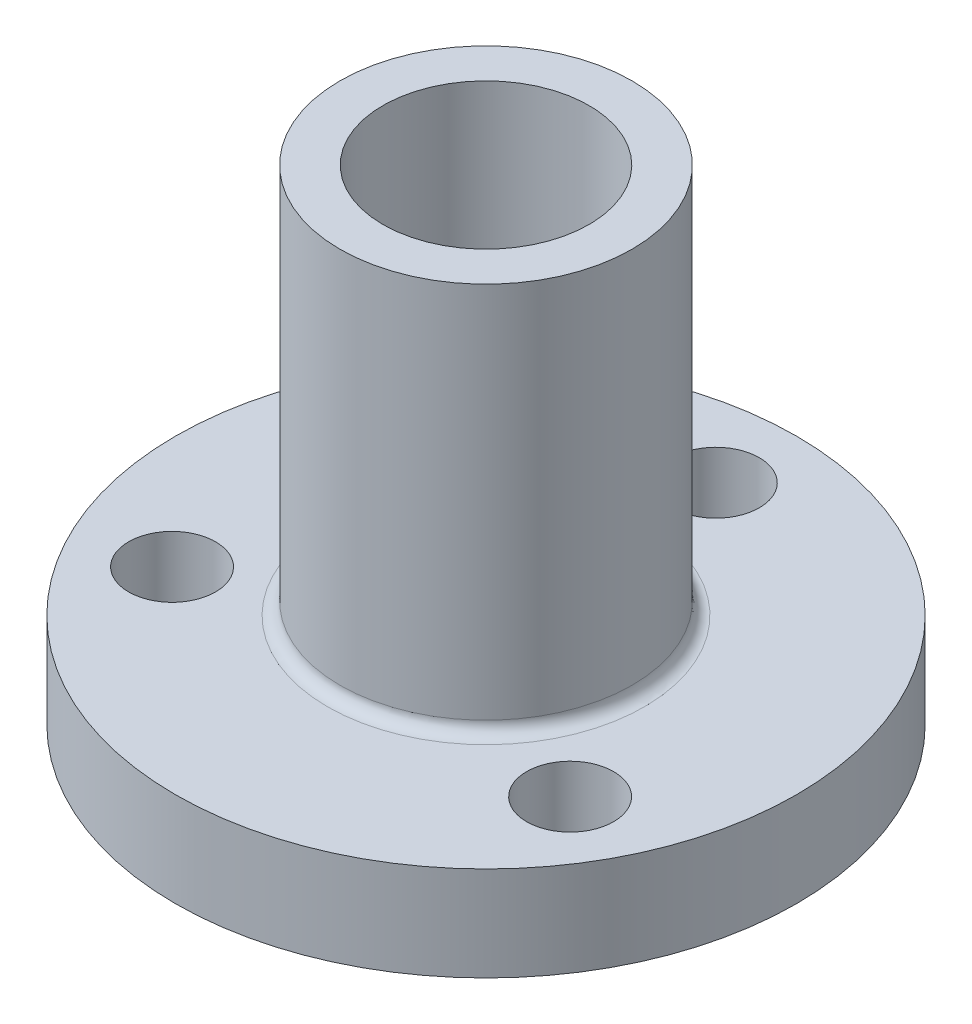
ISO-10303-21;
HEADER;
FILE_DESCRIPTION(('STEP AP214'),'2;1');
FILE_NAME('part.step','',(''),(''),'','','');
FILE_SCHEMA(('AUTOMOTIVE_DESIGN { 1 0 10303 214 1 1 1 1 }'));
ENDSEC;
DATA;
#1=APPLICATION_CONTEXT('core data for automotive mechanical design processes');
#2=APPLICATION_PROTOCOL_DEFINITION('international standard','automotive_design',2000,#1);
#3=PRODUCT_CONTEXT('',#1,'mechanical');
#4=PRODUCT('Part','Part','',(#3));
#5=PRODUCT_RELATED_PRODUCT_CATEGORY('part','',(#4));
#6=PRODUCT_DEFINITION_FORMATION('','',#4);
#7=PRODUCT_DEFINITION_CONTEXT('part definition',#1,'design');
#8=PRODUCT_DEFINITION('design','',#6,#7);
#9=PRODUCT_DEFINITION_SHAPE('','',#8);
#10=(LENGTH_UNIT() NAMED_UNIT(*) SI_UNIT(.MILLI.,.METRE.));
#11=(NAMED_UNIT(*) PLANE_ANGLE_UNIT() SI_UNIT($,.RADIAN.));
#12=(NAMED_UNIT(*) SI_UNIT($,.STERADIAN.) SOLID_ANGLE_UNIT());
#13=UNCERTAINTY_MEASURE_WITH_UNIT(LENGTH_MEASURE(1.E-05),#10,'distance_accuracy_value','');
#14=(GEOMETRIC_REPRESENTATION_CONTEXT(3) GLOBAL_UNCERTAINTY_ASSIGNED_CONTEXT((#13)) GLOBAL_UNIT_ASSIGNED_CONTEXT((#10,
#11,#12)) REPRESENTATION_CONTEXT('',''));
#15=CARTESIAN_POINT('',(0.,0.,0.));
#16=DIRECTION('',(0.,0.,1.));
#17=DIRECTION('',(1.,0.,0.));
#18=AXIS2_PLACEMENT_3D('',#15,#16,#17);
#19=CARTESIAN_POINT('',(-8.01073498500604,3.8,4.62500000000004));
#20=DIRECTION('',(0.,-1.,0.));
#21=DIRECTION('',(0.,0.,-1.));
#22=AXIS2_PLACEMENT_3D('',#19,#20,#21);
#23=CYLINDRICAL_SURFACE('',#22,1.75);
#24=CARTESIAN_POINT('',(-8.01073498500604,3.8,4.62500000000004));
#25=DIRECTION('',(0.,1.,0.));
#26=DIRECTION('',(0.,0.,1.));
#27=AXIS2_PLACEMENT_3D('',#24,#25,#26);
#28=CIRCLE('',#27,1.75);
#29=CARTESIAN_POINT('',(-8.01073498500604,3.8,6.37500000000004));
#30=VERTEX_POINT('',#29);
#31=EDGE_CURVE('E50',#30,#30,#28,.T.);
#32=ORIENTED_EDGE('',*,*,#31,.T.);
#33=EDGE_LOOP('',(#32));
#34=FACE_BOUND('',#33,.T.);
#35=CARTESIAN_POINT('',(-8.01073498500604,0.,4.62500000000004));
#36=DIRECTION('',(0.,1.,0.));
#37=DIRECTION('',(0.,0.,1.));
#38=AXIS2_PLACEMENT_3D('',#35,#36,#37);
#39=CIRCLE('',#38,1.75);
#40=CARTESIAN_POINT('',(-8.01073498500604,0.,6.37500000000004));
#41=VERTEX_POINT('',#40);
#42=EDGE_CURVE('E57',#41,#41,#39,.T.);
#43=ORIENTED_EDGE('',*,*,#42,.F.);
#44=EDGE_LOOP('',(#43));
#45=FACE_BOUND('',#44,.T.);
#46=ADVANCED_FACE('F35',(#34,#45),#23,.F.);
#47=CARTESIAN_POINT('',(0.,3.8,-9.25));
#48=DIRECTION('',(0.,-1.,0.));
#49=DIRECTION('',(0.,0.,-1.));
#50=AXIS2_PLACEMENT_3D('',#47,#48,#49);
#51=CYLINDRICAL_SURFACE('',#50,1.75);
#52=CARTESIAN_POINT('',(0.,3.8,-9.25));
#53=DIRECTION('',(0.,1.,0.));
#54=DIRECTION('',(0.,0.,1.));
#55=AXIS2_PLACEMENT_3D('',#52,#53,#54);
#56=CIRCLE('',#55,1.75);
#57=CARTESIAN_POINT('',(0.,3.8,-7.5));
#58=VERTEX_POINT('',#57);
#59=EDGE_CURVE('E69',#58,#58,#56,.T.);
#60=ORIENTED_EDGE('',*,*,#59,.T.);
#61=EDGE_LOOP('',(#60));
#62=FACE_BOUND('',#61,.T.);
#63=CARTESIAN_POINT('',(0.,0.,-9.25));
#64=DIRECTION('',(0.,1.,0.));
#65=DIRECTION('',(0.,0.,1.));
#66=AXIS2_PLACEMENT_3D('',#63,#64,#65);
#67=CIRCLE('',#66,1.75);
#68=CARTESIAN_POINT('',(0.,0.,-7.5));
#69=VERTEX_POINT('',#68);
#70=EDGE_CURVE('E60',#69,#69,#67,.T.);
#71=ORIENTED_EDGE('',*,*,#70,.F.);
#72=EDGE_LOOP('',(#71));
#73=FACE_BOUND('',#72,.T.);
#74=ADVANCED_FACE('F101',(#62,#73),#51,.F.);
#75=CARTESIAN_POINT('',(0.,3.8,0.));
#76=DIRECTION('',(0.,-1.,0.));
#77=DIRECTION('',(0.,0.,-1.));
#78=AXIS2_PLACEMENT_3D('',#75,#76,#77);
#79=CYLINDRICAL_SURFACE('',#78,12.5);
#80=CARTESIAN_POINT('',(0.,3.8,0.));
#81=DIRECTION('',(0.,1.,0.));
#82=DIRECTION('',(0.,0.,1.));
#83=AXIS2_PLACEMENT_3D('',#80,#81,#82);
#84=CIRCLE('',#83,12.5);
#85=CARTESIAN_POINT('',(0.,3.8,12.5));
#86=VERTEX_POINT('',#85);
#87=EDGE_CURVE('E56',#86,#86,#84,.T.);
#88=ORIENTED_EDGE('',*,*,#87,.F.);
#89=EDGE_LOOP('',(#88));
#90=FACE_BOUND('',#89,.T.);
#91=CARTESIAN_POINT('',(0.,0.,0.));
#92=DIRECTION('',(0.,1.,0.));
#93=DIRECTION('',(0.,0.,1.));
#94=AXIS2_PLACEMENT_3D('',#91,#92,#93);
#95=CIRCLE('',#94,12.5);
#96=CARTESIAN_POINT('',(0.,0.,12.5));
#97=VERTEX_POINT('',#96);
#98=EDGE_CURVE('E63',#97,#97,#95,.T.);
#99=ORIENTED_EDGE('',*,*,#98,.T.);
#100=EDGE_LOOP('',(#99));
#101=FACE_BOUND('',#100,.T.);
#102=ADVANCED_FACE('F107',(#90,#101),#79,.T.);
#103=CARTESIAN_POINT('',(8.01073498500604,3.8,4.62500000000004));
#104=DIRECTION('',(0.,-1.,0.));
#105=DIRECTION('',(0.,0.,-1.));
#106=AXIS2_PLACEMENT_3D('',#103,#104,#105);
#107=CYLINDRICAL_SURFACE('',#106,1.75);
#108=CARTESIAN_POINT('',(8.01073498500604,3.8,4.62500000000004));
#109=DIRECTION('',(0.,1.,0.));
#110=DIRECTION('',(0.,0.,1.));
#111=AXIS2_PLACEMENT_3D('',#108,#109,#110);
#112=CIRCLE('',#111,1.75);
#113=CARTESIAN_POINT('',(8.01073498500604,3.8,6.37500000000004));
#114=VERTEX_POINT('',#113);
#115=EDGE_CURVE('E46',#114,#114,#112,.F.);
#116=ORIENTED_EDGE('',*,*,#115,.F.);
#117=EDGE_LOOP('',(#116));
#118=FACE_BOUND('',#117,.T.);
#119=CARTESIAN_POINT('',(8.01073498500604,0.,4.62500000000004));
#120=DIRECTION('',(0.,1.,0.));
#121=DIRECTION('',(0.,0.,1.));
#122=AXIS2_PLACEMENT_3D('',#119,#120,#121);
#123=CIRCLE('',#122,1.75);
#124=CARTESIAN_POINT('',(8.01073498500604,0.,6.37500000000004));
#125=VERTEX_POINT('',#124);
#126=EDGE_CURVE('E53',#125,#125,#123,.F.);
#127=ORIENTED_EDGE('',*,*,#126,.T.);
#128=EDGE_LOOP('',(#127));
#129=FACE_BOUND('',#128,.T.);
#130=ADVANCED_FACE('F112',(#118,#129),#107,.F.);
#131=CARTESIAN_POINT('',(0.,3.8,0.));
#132=DIRECTION('',(0.,1.,0.));
#133=DIRECTION('',(0.,0.,1.));
#134=AXIS2_PLACEMENT_3D('',#131,#132,#133);
#135=PLANE('',#134);
#136=CARTESIAN_POINT('',(0.,3.8,0.));
#137=DIRECTION('',(0.,1.,0.));
#138=DIRECTION('',(0.,0.,1.));
#139=AXIS2_PLACEMENT_3D('',#136,#137,#138);
#140=CIRCLE('',#139,6.375);
#141=CARTESIAN_POINT('',(0.,3.8,6.375));
#142=VERTEX_POINT('',#141);
#143=EDGE_CURVE('E10',#142,#142,#140,.F.);
#144=ORIENTED_EDGE('',*,*,#143,.T.);
#145=EDGE_LOOP('',(#144));
#146=FACE_BOUND('',#145,.T.);
#147=ORIENTED_EDGE('',*,*,#87,.T.);
#148=EDGE_LOOP('',(#147));
#149=FACE_BOUND('',#148,.T.);
#150=ORIENTED_EDGE('',*,*,#59,.F.);
#151=EDGE_LOOP('',(#150));
#152=FACE_BOUND('',#151,.T.);
#153=ORIENTED_EDGE('',*,*,#31,.F.);
#154=EDGE_LOOP('',(#153));
#155=FACE_BOUND('',#154,.T.);
#156=ORIENTED_EDGE('',*,*,#115,.T.);
#157=EDGE_LOOP('',(#156));
#158=FACE_BOUND('',#157,.T.);
#159=ADVANCED_FACE('F119',(#146,#149,#152,#155,#158),#135,.T.);
#160=CARTESIAN_POINT('',(0.,0.,0.));
#161=DIRECTION('',(0.,1.,0.));
#162=DIRECTION('',(0.,0.,1.));
#163=AXIS2_PLACEMENT_3D('',#160,#161,#162);
#164=PLANE('',#163);
#165=ORIENTED_EDGE('',*,*,#98,.F.);
#166=EDGE_LOOP('',(#165));
#167=FACE_BOUND('',#166,.T.);
#168=ORIENTED_EDGE('',*,*,#70,.T.);
#169=EDGE_LOOP('',(#168));
#170=FACE_BOUND('',#169,.T.);
#171=ORIENTED_EDGE('',*,*,#42,.T.);
#172=EDGE_LOOP('',(#171));
#173=FACE_BOUND('',#172,.T.);
#174=ORIENTED_EDGE('',*,*,#126,.F.);
#175=EDGE_LOOP('',(#174));
#176=FACE_BOUND('',#175,.T.);
#177=CARTESIAN_POINT('',(0.,0.,0.));
#178=DIRECTION('',(0.,1.,0.));
#179=DIRECTION('',(0.,0.,1.));
#180=AXIS2_PLACEMENT_3D('',#177,#178,#179);
#181=CIRCLE('',#180,4.15);
#182=CARTESIAN_POINT('',(0.,0.,4.15));
#183=VERTEX_POINT('',#182);
#184=EDGE_CURVE('E74',#183,#183,#181,.T.);
#185=ORIENTED_EDGE('',*,*,#184,.T.);
#186=EDGE_LOOP('',(#185));
#187=FACE_BOUND('',#186,.T.);
#188=ADVANCED_FACE('F98',(#167,#170,#173,#176,#187),#164,.F.);
#189=CARTESIAN_POINT('',(0.,19.5,0.));
#190=DIRECTION('',(0.,-1.,0.));
#191=DIRECTION('',(0.,0.,-1.));
#192=AXIS2_PLACEMENT_3D('',#189,#190,#191);
#193=CYLINDRICAL_SURFACE('',#192,4.15);
#194=CARTESIAN_POINT('',(0.,19.5,0.));
#195=DIRECTION('',(0.,1.,0.));
#196=DIRECTION('',(0.,0.,1.));
#197=AXIS2_PLACEMENT_3D('',#194,#195,#196);
#198=CIRCLE('',#197,4.15);
#199=CARTESIAN_POINT('',(0.,19.5,4.15));
#200=VERTEX_POINT('',#199);
#201=EDGE_CURVE('E77',#200,#200,#198,.T.);
#202=ORIENTED_EDGE('',*,*,#201,.T.);
#203=EDGE_LOOP('',(#202));
#204=FACE_BOUND('',#203,.T.);
#205=ORIENTED_EDGE('',*,*,#184,.F.);
#206=EDGE_LOOP('',(#205));
#207=FACE_BOUND('',#206,.T.);
#208=ADVANCED_FACE('F83',(#204,#207),#193,.F.);
#209=CARTESIAN_POINT('',(0.,19.5,0.));
#210=DIRECTION('',(0.,-1.,0.));
#211=DIRECTION('',(0.,0.,-1.));
#212=AXIS2_PLACEMENT_3D('',#209,#210,#211);
#213=CYLINDRICAL_SURFACE('',#212,5.875);
#214=CARTESIAN_POINT('',(0.,4.3,0.));
#215=DIRECTION('',(0.,1.,0.));
#216=DIRECTION('',(0.,0.,1.));
#217=AXIS2_PLACEMENT_3D('',#214,#215,#216);
#218=CIRCLE('',#217,5.875);
#219=CARTESIAN_POINT('',(0.,4.3,5.875));
#220=VERTEX_POINT('',#219);
#221=EDGE_CURVE('E42',#220,#220,#218,.T.);
#222=ORIENTED_EDGE('',*,*,#221,.T.);
#223=EDGE_LOOP('',(#222));
#224=FACE_BOUND('',#223,.T.);
#225=CARTESIAN_POINT('',(0.,19.5,0.));
#226=DIRECTION('',(0.,1.,0.));
#227=DIRECTION('',(0.,0.,1.));
#228=AXIS2_PLACEMENT_3D('',#225,#226,#227);
#229=CIRCLE('',#228,5.875);
#230=CARTESIAN_POINT('',(0.,19.5,5.875));
#231=VERTEX_POINT('',#230);
#232=EDGE_CURVE('E65',#231,#231,#229,.T.);
#233=ORIENTED_EDGE('',*,*,#232,.F.);
#234=EDGE_LOOP('',(#233));
#235=FACE_BOUND('',#234,.T.);
#236=ADVANCED_FACE('F89',(#224,#235),#213,.T.);
#237=CARTESIAN_POINT('',(0.,19.5,0.));
#238=DIRECTION('',(0.,1.,0.));
#239=DIRECTION('',(0.,0.,1.));
#240=AXIS2_PLACEMENT_3D('',#237,#238,#239);
#241=PLANE('',#240);
#242=ORIENTED_EDGE('',*,*,#201,.F.);
#243=EDGE_LOOP('',(#242));
#244=FACE_BOUND('',#243,.T.);
#245=ORIENTED_EDGE('',*,*,#232,.T.);
#246=EDGE_LOOP('',(#245));
#247=FACE_BOUND('',#246,.T.);
#248=ADVANCED_FACE('F86',(#244,#247),#241,.T.);
#249=CARTESIAN_POINT('',(0.,4.3,0.));
#250=DIRECTION('',(0.,1.,0.));
#251=DIRECTION('',(0.,0.,1.));
#252=AXIS2_PLACEMENT_3D('',#249,#250,#251);
#253=TOROIDAL_SURFACE('',#252,6.375,0.5);
#254=ORIENTED_EDGE('',*,*,#143,.F.);
#255=EDGE_LOOP('',(#254));
#256=FACE_BOUND('',#255,.T.);
#257=ORIENTED_EDGE('',*,*,#221,.F.);
#258=EDGE_LOOP('',(#257));
#259=FACE_BOUND('',#258,.T.);
#260=ADVANCED_FACE('F37',(#256,#259),#253,.F.);
#261=CLOSED_SHELL('',(#46,#74,#102,#130,#159,#188,#208,#236,#248,#260));
#262=MANIFOLD_SOLID_BREP('B2',#261);
#263=ADVANCED_BREP_SHAPE_REPRESENTATION('',(#18,#262),#14);
#264=SHAPE_DEFINITION_REPRESENTATION(#9,#263);
ENDSEC;
END-ISO-10303-21;
